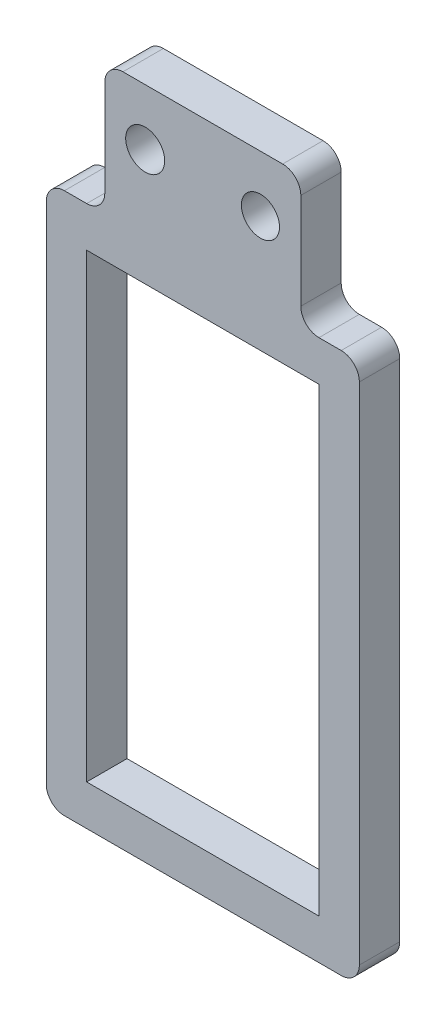
ISO-10303-21;
HEADER;
FILE_DESCRIPTION(('STEP AP214'),'2;1');
FILE_NAME('part.step','',(''),(''),'','','');
FILE_SCHEMA(('AUTOMOTIVE_DESIGN { 1 0 10303 214 1 1 1 1 }'));
ENDSEC;
DATA;
#1=APPLICATION_CONTEXT('core data for automotive mechanical design processes');
#2=APPLICATION_PROTOCOL_DEFINITION('international standard','automotive_design',2000,#1);
#3=PRODUCT_CONTEXT('',#1,'mechanical');
#4=PRODUCT('Part','Part','',(#3));
#5=PRODUCT_RELATED_PRODUCT_CATEGORY('part','',(#4));
#6=PRODUCT_DEFINITION_FORMATION('','',#4);
#7=PRODUCT_DEFINITION_CONTEXT('part definition',#1,'design');
#8=PRODUCT_DEFINITION('design','',#6,#7);
#9=PRODUCT_DEFINITION_SHAPE('','',#8);
#10=(LENGTH_UNIT() NAMED_UNIT(*) SI_UNIT(.MILLI.,.METRE.));
#11=(NAMED_UNIT(*) PLANE_ANGLE_UNIT() SI_UNIT($,.RADIAN.));
#12=(NAMED_UNIT(*) SI_UNIT($,.STERADIAN.) SOLID_ANGLE_UNIT());
#13=UNCERTAINTY_MEASURE_WITH_UNIT(LENGTH_MEASURE(1.E-05),#10,'distance_accuracy_value','');
#14=(GEOMETRIC_REPRESENTATION_CONTEXT(3) GLOBAL_UNCERTAINTY_ASSIGNED_CONTEXT((#13)) GLOBAL_UNIT_ASSIGNED_CONTEXT((#10,
#11,#12)) REPRESENTATION_CONTEXT('',''));
#15=CARTESIAN_POINT('',(0.,0.,0.));
#16=DIRECTION('',(0.,0.,1.));
#17=DIRECTION('',(1.,0.,0.));
#18=AXIS2_PLACEMENT_3D('',#15,#16,#17);
#19=CARTESIAN_POINT('',(0.,0.,4.45));
#20=DIRECTION('',(0.,0.,1.));
#21=DIRECTION('',(1.,0.,0.));
#22=AXIS2_PLACEMENT_3D('',#19,#20,#21);
#23=PLANE('',#22);
#24=CARTESIAN_POINT('',(12.7000000000003,-2.4980018054066E-13,4.45));
#25=DIRECTION('',(0.,0.,1.));
#26=DIRECTION('',(1.,0.,0.));
#27=AXIS2_PLACEMENT_3D('',#24,#25,#26);
#28=CIRCLE('',#27,2.1);
#29=CARTESIAN_POINT('',(14.8000000000003,-2.4980018054066E-13,4.45));
#30=VERTEX_POINT('',#29);
#31=EDGE_CURVE('E309',#30,#30,#28,.F.);
#32=ORIENTED_EDGE('',*,*,#31,.T.);
#33=EDGE_LOOP('',(#32));
#34=FACE_BOUND('',#33,.T.);
#35=DIRECTION('',(0.,-1.,0.));
#36=VECTOR('',#35,1.);
#37=CARTESIAN_POINT('',(-10.9,-8.37499999999999,4.45));
#38=LINE('',#37,#36);
#39=CARTESIAN_POINT('',(-10.9,-10.375,4.45));
#40=VERTEX_POINT('',#39);
#41=CARTESIAN_POINT('',(-10.9,-66.025,4.45));
#42=VERTEX_POINT('',#41);
#43=EDGE_CURVE('E341',#40,#42,#38,.T.);
#44=ORIENTED_EDGE('',*,*,#43,.T.);
#45=CARTESIAN_POINT('',(-8.89999999999997,-66.025,4.45));
#46=DIRECTION('',(0.,0.,1.));
#47=DIRECTION('',(1.,0.,0.));
#48=AXIS2_PLACEMENT_3D('',#45,#46,#47);
#49=CIRCLE('',#48,2.);
#50=CARTESIAN_POINT('',(-8.89999999999997,-68.025,4.45));
#51=VERTEX_POINT('',#50);
#52=EDGE_CURVE('E397',#42,#51,#49,.T.);
#53=ORIENTED_EDGE('',*,*,#52,.T.);
#54=DIRECTION('',(1.,0.,0.));
#55=VECTOR('',#54,1.);
#56=CARTESIAN_POINT('',(-10.9,-68.025,4.45));
#57=LINE('',#56,#55);
#58=CARTESIAN_POINT('',(21.6,-68.025,4.45));
#59=VERTEX_POINT('',#58);
#60=EDGE_CURVE('E338',#51,#59,#57,.T.);
#61=ORIENTED_EDGE('',*,*,#60,.T.);
#62=CARTESIAN_POINT('',(21.6,-66.025,4.45));
#63=DIRECTION('',(0.,0.,1.));
#64=DIRECTION('',(1.,0.,0.));
#65=AXIS2_PLACEMENT_3D('',#62,#63,#64);
#66=CIRCLE('',#65,2.);
#67=CARTESIAN_POINT('',(23.6,-66.025,4.45));
#68=VERTEX_POINT('',#67);
#69=EDGE_CURVE('E395',#59,#68,#66,.T.);
#70=ORIENTED_EDGE('',*,*,#69,.T.);
#71=DIRECTION('',(0.,1.,0.));
#72=VECTOR('',#71,1.);
#73=CARTESIAN_POINT('',(23.6,-68.025,4.45));
#74=LINE('',#73,#72);
#75=CARTESIAN_POINT('',(23.6,-10.375,4.45));
#76=VERTEX_POINT('',#75);
#77=EDGE_CURVE('E335',#68,#76,#74,.T.);
#78=ORIENTED_EDGE('',*,*,#77,.T.);
#79=CARTESIAN_POINT('',(21.6,-10.375,4.45));
#80=DIRECTION('',(0.,0.,1.));
#81=DIRECTION('',(1.,0.,0.));
#82=AXIS2_PLACEMENT_3D('',#79,#80,#81);
#83=CIRCLE('',#82,2.);
#84=CARTESIAN_POINT('',(21.6,-8.37499999999999,4.45));
#85=VERTEX_POINT('',#84);
#86=EDGE_CURVE('E391',#76,#85,#83,.T.);
#87=ORIENTED_EDGE('',*,*,#86,.T.);
#88=DIRECTION('',(-1.,0.,0.));
#89=VECTOR('',#88,1.);
#90=CARTESIAN_POINT('',(23.6,-8.37499999999999,4.45));
#91=LINE('',#90,#89);
#92=CARTESIAN_POINT('',(19.1499999999993,-8.37499999999999,4.45));
#93=VERTEX_POINT('',#92);
#94=EDGE_CURVE('E332',#85,#93,#91,.T.);
#95=ORIENTED_EDGE('',*,*,#94,.T.);
#96=CARTESIAN_POINT('',(19.1499999999993,-6.37499999999999,4.45));
#97=DIRECTION('',(0.,0.,1.));
#98=DIRECTION('',(1.,0.,0.));
#99=AXIS2_PLACEMENT_3D('',#96,#97,#98);
#100=CIRCLE('',#99,2.);
#101=CARTESIAN_POINT('',(17.1499999999993,-6.37499999999999,4.45));
#102=VERTEX_POINT('',#101);
#103=EDGE_CURVE('E430',#93,#102,#100,.F.);
#104=ORIENTED_EDGE('',*,*,#103,.T.);
#105=DIRECTION('',(0.,1.,0.));
#106=VECTOR('',#105,1.);
#107=CARTESIAN_POINT('',(17.1499999999993,-8.37499999999999,4.45));
#108=LINE('',#107,#106);
#109=CARTESIAN_POINT('',(17.1499999999993,4.19999999999979,4.45));
#110=VERTEX_POINT('',#109);
#111=EDGE_CURVE('E329',#102,#110,#108,.T.);
#112=ORIENTED_EDGE('',*,*,#111,.T.);
#113=CARTESIAN_POINT('',(15.1499999999993,4.19999999999979,4.45));
#114=DIRECTION('',(0.,0.,1.));
#115=DIRECTION('',(1.,0.,0.));
#116=AXIS2_PLACEMENT_3D('',#113,#114,#115);
#117=CIRCLE('',#116,2.);
#118=CARTESIAN_POINT('',(15.1499999999993,6.19999999999979,4.45));
#119=VERTEX_POINT('',#118);
#120=EDGE_CURVE('E389',#110,#119,#117,.T.);
#121=ORIENTED_EDGE('',*,*,#120,.T.);
#122=DIRECTION('',(-1.,0.,0.));
#123=VECTOR('',#122,1.);
#124=CARTESIAN_POINT('',(17.1499999999993,6.19999999999979,4.45));
#125=LINE('',#124,#123);
#126=CARTESIAN_POINT('',(-2.45,6.19999999999979,4.45));
#127=VERTEX_POINT('',#126);
#128=EDGE_CURVE('E327',#119,#127,#125,.T.);
#129=ORIENTED_EDGE('',*,*,#128,.T.);
#130=CARTESIAN_POINT('',(-2.45,4.19999999999979,4.45));
#131=DIRECTION('',(0.,0.,1.));
#132=DIRECTION('',(1.,0.,0.));
#133=AXIS2_PLACEMENT_3D('',#130,#131,#132);
#134=CIRCLE('',#133,2.);
#135=CARTESIAN_POINT('',(-4.45,4.19999999999979,4.45));
#136=VERTEX_POINT('',#135);
#137=EDGE_CURVE('E144',#127,#136,#134,.T.);
#138=ORIENTED_EDGE('',*,*,#137,.T.);
#139=DIRECTION('',(0.,1.,0.));
#140=VECTOR('',#139,1.);
#141=CARTESIAN_POINT('',(-4.45,-8.37499999999999,4.45));
#142=LINE('',#141,#140);
#143=CARTESIAN_POINT('',(-4.45,-6.37499999999999,4.45));
#144=VERTEX_POINT('',#143);
#145=EDGE_CURVE('E324',#144,#136,#142,.T.);
#146=ORIENTED_EDGE('',*,*,#145,.F.);
#147=CARTESIAN_POINT('',(-6.45,-6.37499999999999,4.45));
#148=DIRECTION('',(0.,0.,1.));
#149=DIRECTION('',(1.,0.,0.));
#150=AXIS2_PLACEMENT_3D('',#147,#148,#149);
#151=CIRCLE('',#150,2.);
#152=CARTESIAN_POINT('',(-6.45,-8.37499999999999,4.45));
#153=VERTEX_POINT('',#152);
#154=EDGE_CURVE('E12',#144,#153,#151,.F.);
#155=ORIENTED_EDGE('',*,*,#154,.T.);
#156=DIRECTION('',(1.,0.,0.));
#157=VECTOR('',#156,1.);
#158=CARTESIAN_POINT('',(-10.9,-8.37499999999999,4.45));
#159=LINE('',#158,#157);
#160=CARTESIAN_POINT('',(-8.89999999999998,-8.37499999999999,4.45));
#161=VERTEX_POINT('',#160);
#162=EDGE_CURVE('E321',#161,#153,#159,.T.);
#163=ORIENTED_EDGE('',*,*,#162,.F.);
#164=CARTESIAN_POINT('',(-8.89999999999998,-10.375,4.45));
#165=DIRECTION('',(0.,0.,1.));
#166=DIRECTION('',(1.,0.,0.));
#167=AXIS2_PLACEMENT_3D('',#164,#165,#166);
#168=CIRCLE('',#167,2.);
#169=EDGE_CURVE('E393',#161,#40,#168,.T.);
#170=ORIENTED_EDGE('',*,*,#169,.T.);
#171=EDGE_LOOP('',(#44,#53,#61,#70,#78,#87,#95,#104,#112,#121,#129,#138,#146,#155,#163,#170));
#172=FACE_BOUND('',#171,.T.);
#173=CARTESIAN_POINT('',(0.,0.,4.45));
#174=DIRECTION('',(0.,0.,1.));
#175=DIRECTION('',(1.,0.,0.));
#176=AXIS2_PLACEMENT_3D('',#173,#174,#175);
#177=CIRCLE('',#176,2.15);
#178=CARTESIAN_POINT('',(2.15,0.,4.45));
#179=VERTEX_POINT('',#178);
#180=EDGE_CURVE('E315',#179,#179,#177,.T.);
#181=ORIENTED_EDGE('',*,*,#180,.F.);
#182=EDGE_LOOP('',(#181));
#183=FACE_BOUND('',#182,.T.);
#184=DIRECTION('',(0.,-1.,0.));
#185=VECTOR('',#184,1.);
#186=CARTESIAN_POINT('',(-6.44999999999999,0.,4.45));
#187=LINE('',#186,#185);
#188=CARTESIAN_POINT('',(-6.44999999999999,-12.825,4.45));
#189=VERTEX_POINT('',#188);
#190=CARTESIAN_POINT('',(-6.44999999999998,-63.575,4.45));
#191=VERTEX_POINT('',#190);
#192=EDGE_CURVE('E278',#189,#191,#187,.T.);
#193=ORIENTED_EDGE('',*,*,#192,.F.);
#194=DIRECTION('',(-1.,0.,0.));
#195=VECTOR('',#194,1.);
#196=CARTESIAN_POINT('',(0.,-12.825,4.45));
#197=LINE('',#196,#195);
#198=CARTESIAN_POINT('',(19.15,-12.825,4.45));
#199=VERTEX_POINT('',#198);
#200=EDGE_CURVE('E268',#199,#189,#197,.T.);
#201=ORIENTED_EDGE('',*,*,#200,.F.);
#202=DIRECTION('',(0.,1.,0.));
#203=VECTOR('',#202,1.);
#204=CARTESIAN_POINT('',(19.15,0.,4.45));
#205=LINE('',#204,#203);
#206=CARTESIAN_POINT('',(19.15,-63.575,4.45));
#207=VERTEX_POINT('',#206);
#208=EDGE_CURVE('E293',#207,#199,#205,.T.);
#209=ORIENTED_EDGE('',*,*,#208,.F.);
#210=DIRECTION('',(1.,0.,0.));
#211=VECTOR('',#210,1.);
#212=CARTESIAN_POINT('',(0.,-63.575,4.45));
#213=LINE('',#212,#211);
#214=EDGE_CURVE('E291',#191,#207,#213,.T.);
#215=ORIENTED_EDGE('',*,*,#214,.F.);
#216=EDGE_LOOP('',(#193,#201,#209,#215));
#217=FACE_BOUND('',#216,.T.);
#218=ADVANCED_FACE('F129',(#34,#172,#183,#217),#23,.T.);
#219=CARTESIAN_POINT('',(0.,0.,0.));
#220=DIRECTION('',(0.,0.,1.));
#221=DIRECTION('',(1.,0.,0.));
#222=AXIS2_PLACEMENT_3D('',#219,#220,#221);
#223=PLANE('',#222);
#224=CARTESIAN_POINT('',(0.,0.,0.));
#225=DIRECTION('',(0.,0.,1.));
#226=DIRECTION('',(1.,0.,0.));
#227=AXIS2_PLACEMENT_3D('',#224,#225,#226);
#228=CIRCLE('',#227,2.15);
#229=CARTESIAN_POINT('',(2.15,0.,0.));
#230=VERTEX_POINT('',#229);
#231=EDGE_CURVE('E312',#230,#230,#228,.T.);
#232=ORIENTED_EDGE('',*,*,#231,.T.);
#233=EDGE_LOOP('',(#232));
#234=FACE_BOUND('',#233,.T.);
#235=DIRECTION('',(1.,0.,0.));
#236=VECTOR('',#235,1.);
#237=CARTESIAN_POINT('',(-10.9,-68.025,0.));
#238=LINE('',#237,#236);
#239=CARTESIAN_POINT('',(-8.89999999999997,-68.025,0.));
#240=VERTEX_POINT('',#239);
#241=CARTESIAN_POINT('',(21.6,-68.025,0.));
#242=VERTEX_POINT('',#241);
#243=EDGE_CURVE('E362',#240,#242,#238,.T.);
#244=ORIENTED_EDGE('',*,*,#243,.F.);
#245=CARTESIAN_POINT('',(-8.89999999999997,-66.025,0.));
#246=DIRECTION('',(0.,0.,1.));
#247=DIRECTION('',(1.,0.,0.));
#248=AXIS2_PLACEMENT_3D('',#245,#246,#247);
#249=CIRCLE('',#248,2.);
#250=CARTESIAN_POINT('',(-10.9,-66.025,0.));
#251=VERTEX_POINT('',#250);
#252=EDGE_CURVE('E381',#240,#251,#249,.F.);
#253=ORIENTED_EDGE('',*,*,#252,.T.);
#254=DIRECTION('',(0.,-1.,0.));
#255=VECTOR('',#254,1.);
#256=CARTESIAN_POINT('',(-10.9,-8.37499999999999,0.));
#257=LINE('',#256,#255);
#258=CARTESIAN_POINT('',(-10.9,-10.375,0.));
#259=VERTEX_POINT('',#258);
#260=EDGE_CURVE('E325',#259,#251,#257,.T.);
#261=ORIENTED_EDGE('',*,*,#260,.F.);
#262=CARTESIAN_POINT('',(-8.89999999999998,-10.375,0.));
#263=DIRECTION('',(0.,0.,1.));
#264=DIRECTION('',(1.,0.,0.));
#265=AXIS2_PLACEMENT_3D('',#262,#263,#264);
#266=CIRCLE('',#265,2.);
#267=CARTESIAN_POINT('',(-8.89999999999998,-8.37499999999999,0.));
#268=VERTEX_POINT('',#267);
#269=EDGE_CURVE('E377',#259,#268,#266,.F.);
#270=ORIENTED_EDGE('',*,*,#269,.T.);
#271=DIRECTION('',(1.,0.,0.));
#272=VECTOR('',#271,1.);
#273=CARTESIAN_POINT('',(-10.9,-8.37499999999999,0.));
#274=LINE('',#273,#272);
#275=CARTESIAN_POINT('',(-6.45,-8.37499999999999,0.));
#276=VERTEX_POINT('',#275);
#277=EDGE_CURVE('E318',#268,#276,#274,.T.);
#278=ORIENTED_EDGE('',*,*,#277,.T.);
#279=CARTESIAN_POINT('',(-6.45,-6.37499999999999,0.));
#280=DIRECTION('',(0.,0.,1.));
#281=DIRECTION('',(1.,0.,0.));
#282=AXIS2_PLACEMENT_3D('',#279,#280,#281);
#283=CIRCLE('',#282,2.);
#284=CARTESIAN_POINT('',(-4.45,-6.37499999999999,0.));
#285=VERTEX_POINT('',#284);
#286=EDGE_CURVE('E137',#276,#285,#283,.T.);
#287=ORIENTED_EDGE('',*,*,#286,.T.);
#288=DIRECTION('',(0.,1.,0.));
#289=VECTOR('',#288,1.);
#290=CARTESIAN_POINT('',(-4.45,-8.37499999999999,0.));
#291=LINE('',#290,#289);
#292=CARTESIAN_POINT('',(-4.45,4.19999999999979,0.));
#293=VERTEX_POINT('',#292);
#294=EDGE_CURVE('E347',#285,#293,#291,.T.);
#295=ORIENTED_EDGE('',*,*,#294,.T.);
#296=CARTESIAN_POINT('',(-2.45,4.19999999999979,0.));
#297=DIRECTION('',(0.,0.,1.));
#298=DIRECTION('',(1.,0.,0.));
#299=AXIS2_PLACEMENT_3D('',#296,#297,#298);
#300=CIRCLE('',#299,2.);
#301=CARTESIAN_POINT('',(-2.45,6.19999999999979,0.));
#302=VERTEX_POINT('',#301);
#303=EDGE_CURVE('E371',#293,#302,#300,.F.);
#304=ORIENTED_EDGE('',*,*,#303,.T.);
#305=DIRECTION('',(-1.,0.,0.));
#306=VECTOR('',#305,1.);
#307=CARTESIAN_POINT('',(17.1499999999993,6.19999999999979,0.));
#308=LINE('',#307,#306);
#309=CARTESIAN_POINT('',(15.1499999999993,6.19999999999979,0.));
#310=VERTEX_POINT('',#309);
#311=EDGE_CURVE('E350',#310,#302,#308,.T.);
#312=ORIENTED_EDGE('',*,*,#311,.F.);
#313=CARTESIAN_POINT('',(15.1499999999993,4.19999999999979,0.));
#314=DIRECTION('',(0.,0.,1.));
#315=DIRECTION('',(1.,0.,0.));
#316=AXIS2_PLACEMENT_3D('',#313,#314,#315);
#317=CIRCLE('',#316,2.);
#318=CARTESIAN_POINT('',(17.1499999999993,4.19999999999979,0.));
#319=VERTEX_POINT('',#318);
#320=EDGE_CURVE('E373',#310,#319,#317,.F.);
#321=ORIENTED_EDGE('',*,*,#320,.T.);
#322=DIRECTION('',(0.,1.,0.));
#323=VECTOR('',#322,1.);
#324=CARTESIAN_POINT('',(17.1499999999993,-8.37499999999999,0.));
#325=LINE('',#324,#323);
#326=CARTESIAN_POINT('',(17.1499999999993,-6.37499999999999,0.));
#327=VERTEX_POINT('',#326);
#328=EDGE_CURVE('E353',#327,#319,#325,.T.);
#329=ORIENTED_EDGE('',*,*,#328,.F.);
#330=CARTESIAN_POINT('',(19.1499999999993,-6.37499999999999,0.));
#331=DIRECTION('',(0.,0.,1.));
#332=DIRECTION('',(1.,0.,0.));
#333=AXIS2_PLACEMENT_3D('',#330,#331,#332);
#334=CIRCLE('',#333,2.);
#335=CARTESIAN_POINT('',(19.1499999999993,-8.37499999999999,0.));
#336=VERTEX_POINT('',#335);
#337=EDGE_CURVE('E428',#327,#336,#334,.T.);
#338=ORIENTED_EDGE('',*,*,#337,.T.);
#339=DIRECTION('',(-1.,0.,0.));
#340=VECTOR('',#339,1.);
#341=CARTESIAN_POINT('',(23.6,-8.37499999999999,0.));
#342=LINE('',#341,#340);
#343=CARTESIAN_POINT('',(21.6,-8.37499999999999,0.));
#344=VERTEX_POINT('',#343);
#345=EDGE_CURVE('E356',#344,#336,#342,.T.);
#346=ORIENTED_EDGE('',*,*,#345,.F.);
#347=CARTESIAN_POINT('',(21.6,-10.375,0.));
#348=DIRECTION('',(0.,0.,1.));
#349=DIRECTION('',(1.,0.,0.));
#350=AXIS2_PLACEMENT_3D('',#347,#348,#349);
#351=CIRCLE('',#350,2.);
#352=CARTESIAN_POINT('',(23.6,-10.375,0.));
#353=VERTEX_POINT('',#352);
#354=EDGE_CURVE('E375',#344,#353,#351,.F.);
#355=ORIENTED_EDGE('',*,*,#354,.T.);
#356=DIRECTION('',(0.,1.,0.));
#357=VECTOR('',#356,1.);
#358=CARTESIAN_POINT('',(23.6,-68.025,0.));
#359=LINE('',#358,#357);
#360=CARTESIAN_POINT('',(23.6,-66.025,0.));
#361=VERTEX_POINT('',#360);
#362=EDGE_CURVE('E359',#361,#353,#359,.T.);
#363=ORIENTED_EDGE('',*,*,#362,.F.);
#364=CARTESIAN_POINT('',(21.6,-66.025,0.));
#365=DIRECTION('',(0.,0.,1.));
#366=DIRECTION('',(1.,0.,0.));
#367=AXIS2_PLACEMENT_3D('',#364,#365,#366);
#368=CIRCLE('',#367,2.);
#369=EDGE_CURVE('E379',#361,#242,#368,.F.);
#370=ORIENTED_EDGE('',*,*,#369,.T.);
#371=EDGE_LOOP('',(#244,#253,#261,#270,#278,#287,#295,#304,#312,#321,#329,#338,#346,#355,#363,#370));
#372=FACE_BOUND('',#371,.T.);
#373=CARTESIAN_POINT('',(12.7000000000003,-2.4980018054066E-13,0.));
#374=DIRECTION('',(0.,0.,1.));
#375=DIRECTION('',(1.,0.,0.));
#376=AXIS2_PLACEMENT_3D('',#373,#374,#375);
#377=CIRCLE('',#376,2.1);
#378=CARTESIAN_POINT('',(14.8000000000003,-2.4980018054066E-13,0.));
#379=VERTEX_POINT('',#378);
#380=EDGE_CURVE('E286',#379,#379,#377,.F.);
#381=ORIENTED_EDGE('',*,*,#380,.F.);
#382=EDGE_LOOP('',(#381));
#383=FACE_BOUND('',#382,.T.);
#384=DIRECTION('',(-1.,0.,0.));
#385=VECTOR('',#384,1.);
#386=CARTESIAN_POINT('',(0.,-12.825,0.));
#387=LINE('',#386,#385);
#388=CARTESIAN_POINT('',(19.15,-12.825,0.));
#389=VERTEX_POINT('',#388);
#390=CARTESIAN_POINT('',(-6.44999999999999,-12.825,0.));
#391=VERTEX_POINT('',#390);
#392=EDGE_CURVE('E297',#389,#391,#387,.T.);
#393=ORIENTED_EDGE('',*,*,#392,.T.);
#394=DIRECTION('',(0.,-1.,0.));
#395=VECTOR('',#394,1.);
#396=CARTESIAN_POINT('',(-6.44999999999999,0.,0.));
#397=LINE('',#396,#395);
#398=CARTESIAN_POINT('',(-6.44999999999998,-63.575,0.));
#399=VERTEX_POINT('',#398);
#400=EDGE_CURVE('E285',#391,#399,#397,.T.);
#401=ORIENTED_EDGE('',*,*,#400,.T.);
#402=DIRECTION('',(1.,0.,0.));
#403=VECTOR('',#402,1.);
#404=CARTESIAN_POINT('',(0.,-63.575,0.));
#405=LINE('',#404,#403);
#406=CARTESIAN_POINT('',(19.15,-63.575,0.));
#407=VERTEX_POINT('',#406);
#408=EDGE_CURVE('E300',#399,#407,#405,.T.);
#409=ORIENTED_EDGE('',*,*,#408,.T.);
#410=DIRECTION('',(0.,1.,0.));
#411=VECTOR('',#410,1.);
#412=CARTESIAN_POINT('',(19.15,0.,0.));
#413=LINE('',#412,#411);
#414=EDGE_CURVE('E279',#407,#389,#413,.T.);
#415=ORIENTED_EDGE('',*,*,#414,.T.);
#416=EDGE_LOOP('',(#393,#401,#409,#415));
#417=FACE_BOUND('',#416,.T.);
#418=ADVANCED_FACE('F433',(#234,#372,#383,#417),#223,.F.);
#419=CARTESIAN_POINT('',(-10.9,-8.37499999999999,4.45));
#420=DIRECTION('',(0.,1.,0.));
#421=DIRECTION('',(0.,0.,1.));
#422=AXIS2_PLACEMENT_3D('',#419,#420,#421);
#423=PLANE('',#422);
#424=ORIENTED_EDGE('',*,*,#277,.F.);
#425=DIRECTION('',(0.,0.,-1.));
#426=VECTOR('',#425,1.);
#427=CARTESIAN_POINT('',(-8.89999999999998,-8.37499999999999,4.45));
#428=LINE('',#427,#426);
#429=EDGE_CURVE('E407',#268,#161,#428,.F.);
#430=ORIENTED_EDGE('',*,*,#429,.T.);
#431=ORIENTED_EDGE('',*,*,#162,.T.);
#432=DIRECTION('',(0.,0.,-1.));
#433=VECTOR('',#432,1.);
#434=CARTESIAN_POINT('',(-6.45,-8.37499999999999,0.));
#435=LINE('',#434,#433);
#436=EDGE_CURVE('E404',#153,#276,#435,.T.);
#437=ORIENTED_EDGE('',*,*,#436,.T.);
#438=EDGE_LOOP('',(#424,#430,#431,#437));
#439=FACE_BOUND('',#438,.T.);
#440=ADVANCED_FACE('F445',(#439),#423,.T.);
#441=CARTESIAN_POINT('',(-10.9,-8.37499999999999,4.45));
#442=DIRECTION('',(1.,0.,0.));
#443=DIRECTION('',(0.,1.,0.));
#444=AXIS2_PLACEMENT_3D('',#441,#442,#443);
#445=PLANE('',#444);
#446=ORIENTED_EDGE('',*,*,#260,.T.);
#447=DIRECTION('',(0.,0.,-1.));
#448=VECTOR('',#447,1.);
#449=CARTESIAN_POINT('',(-10.9,-66.025,4.45));
#450=LINE('',#449,#448);
#451=EDGE_CURVE('E386',#251,#42,#450,.F.);
#452=ORIENTED_EDGE('',*,*,#451,.T.);
#453=ORIENTED_EDGE('',*,*,#43,.F.);
#454=DIRECTION('',(0.,0.,-1.));
#455=VECTOR('',#454,1.);
#456=CARTESIAN_POINT('',(-10.9,-10.375,0.));
#457=LINE('',#456,#455);
#458=EDGE_CURVE('E383',#40,#259,#457,.T.);
#459=ORIENTED_EDGE('',*,*,#458,.T.);
#460=EDGE_LOOP('',(#446,#452,#453,#459));
#461=FACE_BOUND('',#460,.T.);
#462=ADVANCED_FACE('F453',(#461),#445,.F.);
#463=CARTESIAN_POINT('',(-10.9,-68.025,4.45));
#464=DIRECTION('',(0.,1.,0.));
#465=DIRECTION('',(-1.,0.,0.));
#466=AXIS2_PLACEMENT_3D('',#463,#464,#465);
#467=PLANE('',#466);
#468=ORIENTED_EDGE('',*,*,#60,.F.);
#469=DIRECTION('',(0.,0.,-1.));
#470=VECTOR('',#469,1.);
#471=CARTESIAN_POINT('',(-8.89999999999997,-68.025,4.45));
#472=LINE('',#471,#470);
#473=EDGE_CURVE('E368',#51,#240,#472,.T.);
#474=ORIENTED_EDGE('',*,*,#473,.T.);
#475=ORIENTED_EDGE('',*,*,#243,.T.);
#476=DIRECTION('',(0.,0.,-1.));
#477=VECTOR('',#476,1.);
#478=CARTESIAN_POINT('',(21.6,-68.025,4.45));
#479=LINE('',#478,#477);
#480=EDGE_CURVE('E344',#242,#59,#479,.F.);
#481=ORIENTED_EDGE('',*,*,#480,.T.);
#482=EDGE_LOOP('',(#468,#474,#475,#481));
#483=FACE_BOUND('',#482,.T.);
#484=ADVANCED_FACE('F462',(#483),#467,.F.);
#485=CARTESIAN_POINT('',(23.6,-68.025,4.45));
#486=DIRECTION('',(-1.,0.,0.));
#487=DIRECTION('',(0.,-1.,0.));
#488=AXIS2_PLACEMENT_3D('',#485,#486,#487);
#489=PLANE('',#488);
#490=ORIENTED_EDGE('',*,*,#77,.F.);
#491=DIRECTION('',(0.,0.,-1.));
#492=VECTOR('',#491,1.);
#493=CARTESIAN_POINT('',(23.6,-66.025,4.45));
#494=LINE('',#493,#492);
#495=EDGE_CURVE('E401',#68,#361,#494,.T.);
#496=ORIENTED_EDGE('',*,*,#495,.T.);
#497=ORIENTED_EDGE('',*,*,#362,.T.);
#498=DIRECTION('',(0.,0.,-1.));
#499=VECTOR('',#498,1.);
#500=CARTESIAN_POINT('',(23.6,-10.375,4.45));
#501=LINE('',#500,#499);
#502=EDGE_CURVE('E399',#353,#76,#501,.F.);
#503=ORIENTED_EDGE('',*,*,#502,.T.);
#504=EDGE_LOOP('',(#490,#496,#497,#503));
#505=FACE_BOUND('',#504,.T.);
#506=ADVANCED_FACE('F470',(#505),#489,.F.);
#507=CARTESIAN_POINT('',(23.6,-8.37499999999999,4.45));
#508=DIRECTION('',(0.,-1.,0.));
#509=DIRECTION('',(0.,0.,-1.));
#510=AXIS2_PLACEMENT_3D('',#507,#508,#509);
#511=PLANE('',#510);
#512=ORIENTED_EDGE('',*,*,#94,.F.);
#513=DIRECTION('',(0.,0.,-1.));
#514=VECTOR('',#513,1.);
#515=CARTESIAN_POINT('',(21.6,-8.37499999999999,4.45));
#516=LINE('',#515,#514);
#517=EDGE_CURVE('E411',#85,#344,#516,.T.);
#518=ORIENTED_EDGE('',*,*,#517,.T.);
#519=ORIENTED_EDGE('',*,*,#345,.T.);
#520=DIRECTION('',(0.,0.,-1.));
#521=VECTOR('',#520,1.);
#522=CARTESIAN_POINT('',(19.1499999999993,-8.37499999999999,4.45));
#523=LINE('',#522,#521);
#524=EDGE_CURVE('E409',#336,#93,#523,.F.);
#525=ORIENTED_EDGE('',*,*,#524,.T.);
#526=EDGE_LOOP('',(#512,#518,#519,#525));
#527=FACE_BOUND('',#526,.T.);
#528=ADVANCED_FACE('F479',(#527),#511,.F.);
#529=CARTESIAN_POINT('',(17.1499999999993,-8.37499999999999,4.45));
#530=DIRECTION('',(-1.,0.,0.));
#531=DIRECTION('',(0.,0.,1.));
#532=AXIS2_PLACEMENT_3D('',#529,#530,#531);
#533=PLANE('',#532);
#534=ORIENTED_EDGE('',*,*,#111,.F.);
#535=DIRECTION('',(0.,0.,-1.));
#536=VECTOR('',#535,1.);
#537=CARTESIAN_POINT('',(17.1499999999993,-6.37499999999999,0.));
#538=LINE('',#537,#536);
#539=EDGE_CURVE('E416',#102,#327,#538,.T.);
#540=ORIENTED_EDGE('',*,*,#539,.T.);
#541=ORIENTED_EDGE('',*,*,#328,.T.);
#542=DIRECTION('',(0.,0.,-1.));
#543=VECTOR('',#542,1.);
#544=CARTESIAN_POINT('',(17.1499999999993,4.19999999999979,4.45));
#545=LINE('',#544,#543);
#546=EDGE_CURVE('E414',#319,#110,#545,.F.);
#547=ORIENTED_EDGE('',*,*,#546,.T.);
#548=EDGE_LOOP('',(#534,#540,#541,#547));
#549=FACE_BOUND('',#548,.T.);
#550=ADVANCED_FACE('F488',(#549),#533,.F.);
#551=CARTESIAN_POINT('',(17.1499999999993,6.19999999999979,4.45));
#552=DIRECTION('',(0.,-1.,0.));
#553=DIRECTION('',(0.,0.,-1.));
#554=AXIS2_PLACEMENT_3D('',#551,#552,#553);
#555=PLANE('',#554);
#556=ORIENTED_EDGE('',*,*,#128,.F.);
#557=DIRECTION('',(0.,0.,-1.));
#558=VECTOR('',#557,1.);
#559=CARTESIAN_POINT('',(15.1499999999993,6.19999999999979,4.45));
#560=LINE('',#559,#558);
#561=EDGE_CURVE('E421',#119,#310,#560,.T.);
#562=ORIENTED_EDGE('',*,*,#561,.T.);
#563=ORIENTED_EDGE('',*,*,#311,.T.);
#564=DIRECTION('',(0.,0.,-1.));
#565=VECTOR('',#564,1.);
#566=CARTESIAN_POINT('',(-2.45,6.19999999999979,4.45));
#567=LINE('',#566,#565);
#568=EDGE_CURVE('E419',#302,#127,#567,.F.);
#569=ORIENTED_EDGE('',*,*,#568,.T.);
#570=EDGE_LOOP('',(#556,#562,#563,#569));
#571=FACE_BOUND('',#570,.T.);
#572=ADVANCED_FACE('F496',(#571),#555,.F.);
#573=CARTESIAN_POINT('',(-4.45,-8.37499999999999,4.45));
#574=DIRECTION('',(-1.,0.,0.));
#575=DIRECTION('',(0.,0.,1.));
#576=AXIS2_PLACEMENT_3D('',#573,#574,#575);
#577=PLANE('',#576);
#578=ORIENTED_EDGE('',*,*,#145,.T.);
#579=DIRECTION('',(0.,0.,-1.));
#580=VECTOR('',#579,1.);
#581=CARTESIAN_POINT('',(-4.45,4.19999999999979,0.));
#582=LINE('',#581,#580);
#583=EDGE_CURVE('E425',#136,#293,#582,.T.);
#584=ORIENTED_EDGE('',*,*,#583,.T.);
#585=ORIENTED_EDGE('',*,*,#294,.F.);
#586=DIRECTION('',(0.,0.,-1.));
#587=VECTOR('',#586,1.);
#588=CARTESIAN_POINT('',(-4.45,-6.37499999999999,4.45));
#589=LINE('',#588,#587);
#590=EDGE_CURVE('E151',#285,#144,#589,.F.);
#591=ORIENTED_EDGE('',*,*,#590,.T.);
#592=EDGE_LOOP('',(#578,#584,#585,#591));
#593=FACE_BOUND('',#592,.T.);
#594=ADVANCED_FACE('F438',(#593),#577,.T.);
#595=CARTESIAN_POINT('',(0.,0.,4.45));
#596=DIRECTION('',(0.,0.,-1.));
#597=DIRECTION('',(-1.,0.,0.));
#598=AXIS2_PLACEMENT_3D('',#595,#596,#597);
#599=CYLINDRICAL_SURFACE('',#598,2.15);
#600=ORIENTED_EDGE('',*,*,#180,.T.);
#601=EDGE_LOOP('',(#600));
#602=FACE_BOUND('',#601,.T.);
#603=ORIENTED_EDGE('',*,*,#231,.F.);
#604=EDGE_LOOP('',(#603));
#605=FACE_BOUND('',#604,.T.);
#606=ADVANCED_FACE('F517',(#602,#605),#599,.F.);
#607=CARTESIAN_POINT('',(12.7000000000003,-2.4980018054066E-13,4.45));
#608=DIRECTION('',(0.,0.,-1.));
#609=DIRECTION('',(-1.,0.,0.));
#610=AXIS2_PLACEMENT_3D('',#607,#608,#609);
#611=CYLINDRICAL_SURFACE('',#610,2.1);
#612=ORIENTED_EDGE('',*,*,#31,.F.);
#613=EDGE_LOOP('',(#612));
#614=FACE_BOUND('',#613,.T.);
#615=ORIENTED_EDGE('',*,*,#380,.T.);
#616=EDGE_LOOP('',(#615));
#617=FACE_BOUND('',#616,.T.);
#618=ADVANCED_FACE('F617',(#614,#617),#611,.F.);
#619=CARTESIAN_POINT('',(0.,-12.825,4.45));
#620=DIRECTION('',(0.,-1.,0.));
#621=DIRECTION('',(1.,0.,0.));
#622=AXIS2_PLACEMENT_3D('',#619,#620,#621);
#623=PLANE('',#622);
#624=ORIENTED_EDGE('',*,*,#392,.F.);
#625=DIRECTION('',(0.,0.,-1.));
#626=VECTOR('',#625,1.);
#627=CARTESIAN_POINT('',(19.15,-12.825,4.45));
#628=LINE('',#627,#626);
#629=EDGE_CURVE('E274',#199,#389,#628,.T.);
#630=ORIENTED_EDGE('',*,*,#629,.F.);
#631=ORIENTED_EDGE('',*,*,#200,.T.);
#632=DIRECTION('',(0.,0.,-1.));
#633=VECTOR('',#632,1.);
#634=CARTESIAN_POINT('',(-6.44999999999999,-12.825,4.45));
#635=LINE('',#634,#633);
#636=EDGE_CURVE('E271',#189,#391,#635,.T.);
#637=ORIENTED_EDGE('',*,*,#636,.T.);
#638=EDGE_LOOP('',(#624,#630,#631,#637));
#639=FACE_BOUND('',#638,.T.);
#640=ADVANCED_FACE('F270',(#639),#623,.T.);
#641=CARTESIAN_POINT('',(-6.44999999999999,0.,4.45));
#642=DIRECTION('',(1.,0.,0.));
#643=DIRECTION('',(0.,1.,0.));
#644=AXIS2_PLACEMENT_3D('',#641,#642,#643);
#645=PLANE('',#644);
#646=ORIENTED_EDGE('',*,*,#400,.F.);
#647=ORIENTED_EDGE('',*,*,#636,.F.);
#648=ORIENTED_EDGE('',*,*,#192,.T.);
#649=DIRECTION('',(0.,0.,-1.));
#650=VECTOR('',#649,1.);
#651=CARTESIAN_POINT('',(-6.44999999999998,-63.575,4.45));
#652=LINE('',#651,#650);
#653=EDGE_CURVE('E287',#191,#399,#652,.T.);
#654=ORIENTED_EDGE('',*,*,#653,.T.);
#655=EDGE_LOOP('',(#646,#647,#648,#654));
#656=FACE_BOUND('',#655,.T.);
#657=ADVANCED_FACE('F282',(#656),#645,.T.);
#658=CARTESIAN_POINT('',(0.,-63.575,4.45));
#659=DIRECTION('',(0.,1.,0.));
#660=DIRECTION('',(0.,0.,1.));
#661=AXIS2_PLACEMENT_3D('',#658,#659,#660);
#662=PLANE('',#661);
#663=ORIENTED_EDGE('',*,*,#408,.F.);
#664=ORIENTED_EDGE('',*,*,#653,.F.);
#665=ORIENTED_EDGE('',*,*,#214,.T.);
#666=DIRECTION('',(0.,0.,-1.));
#667=VECTOR('',#666,1.);
#668=CARTESIAN_POINT('',(19.15,-63.575,4.45));
#669=LINE('',#668,#667);
#670=EDGE_CURVE('E306',#207,#407,#669,.T.);
#671=ORIENTED_EDGE('',*,*,#670,.T.);
#672=EDGE_LOOP('',(#663,#664,#665,#671));
#673=FACE_BOUND('',#672,.T.);
#674=ADVANCED_FACE('F593',(#673),#662,.T.);
#675=CARTESIAN_POINT('',(19.15,0.,4.45));
#676=DIRECTION('',(-1.,0.,0.));
#677=DIRECTION('',(0.,0.,1.));
#678=AXIS2_PLACEMENT_3D('',#675,#676,#677);
#679=PLANE('',#678);
#680=ORIENTED_EDGE('',*,*,#414,.F.);
#681=ORIENTED_EDGE('',*,*,#670,.F.);
#682=ORIENTED_EDGE('',*,*,#208,.T.);
#683=ORIENTED_EDGE('',*,*,#629,.T.);
#684=EDGE_LOOP('',(#680,#681,#682,#683));
#685=FACE_BOUND('',#684,.T.);
#686=ADVANCED_FACE('F538',(#685),#679,.T.);
#687=CARTESIAN_POINT('',(-8.89999999999997,-66.025,4.45));
#688=DIRECTION('',(0.,0.,-1.));
#689=DIRECTION('',(-1.,0.,0.));
#690=AXIS2_PLACEMENT_3D('',#687,#688,#689);
#691=CYLINDRICAL_SURFACE('',#690,2.);
#692=ORIENTED_EDGE('',*,*,#52,.F.);
#693=ORIENTED_EDGE('',*,*,#451,.F.);
#694=ORIENTED_EDGE('',*,*,#252,.F.);
#695=ORIENTED_EDGE('',*,*,#473,.F.);
#696=EDGE_LOOP('',(#692,#693,#694,#695));
#697=FACE_BOUND('',#696,.T.);
#698=ADVANCED_FACE('F457',(#697),#691,.T.);
#699=CARTESIAN_POINT('',(21.6,-66.025,4.45));
#700=DIRECTION('',(0.,0.,-1.));
#701=DIRECTION('',(-1.,0.,0.));
#702=AXIS2_PLACEMENT_3D('',#699,#700,#701);
#703=CYLINDRICAL_SURFACE('',#702,2.);
#704=ORIENTED_EDGE('',*,*,#69,.F.);
#705=ORIENTED_EDGE('',*,*,#480,.F.);
#706=ORIENTED_EDGE('',*,*,#369,.F.);
#707=ORIENTED_EDGE('',*,*,#495,.F.);
#708=EDGE_LOOP('',(#704,#705,#706,#707));
#709=FACE_BOUND('',#708,.T.);
#710=ADVANCED_FACE('F465',(#709),#703,.T.);
#711=CARTESIAN_POINT('',(-8.89999999999998,-10.375,4.45));
#712=DIRECTION('',(0.,0.,1.));
#713=DIRECTION('',(1.,0.,0.));
#714=AXIS2_PLACEMENT_3D('',#711,#712,#713);
#715=CYLINDRICAL_SURFACE('',#714,2.);
#716=ORIENTED_EDGE('',*,*,#169,.F.);
#717=ORIENTED_EDGE('',*,*,#429,.F.);
#718=ORIENTED_EDGE('',*,*,#269,.F.);
#719=ORIENTED_EDGE('',*,*,#458,.F.);
#720=EDGE_LOOP('',(#716,#717,#718,#719));
#721=FACE_BOUND('',#720,.T.);
#722=ADVANCED_FACE('F448',(#721),#715,.T.);
#723=CARTESIAN_POINT('',(21.6,-10.375,4.45));
#724=DIRECTION('',(0.,0.,-1.));
#725=DIRECTION('',(-1.,0.,0.));
#726=AXIS2_PLACEMENT_3D('',#723,#724,#725);
#727=CYLINDRICAL_SURFACE('',#726,2.);
#728=ORIENTED_EDGE('',*,*,#86,.F.);
#729=ORIENTED_EDGE('',*,*,#502,.F.);
#730=ORIENTED_EDGE('',*,*,#354,.F.);
#731=ORIENTED_EDGE('',*,*,#517,.F.);
#732=EDGE_LOOP('',(#728,#729,#730,#731));
#733=FACE_BOUND('',#732,.T.);
#734=ADVANCED_FACE('F474',(#733),#727,.T.);
#735=CARTESIAN_POINT('',(19.1499999999993,-6.37499999999999,4.45));
#736=DIRECTION('',(0.,0.,1.));
#737=DIRECTION('',(1.,0.,0.));
#738=AXIS2_PLACEMENT_3D('',#735,#736,#737);
#739=CYLINDRICAL_SURFACE('',#738,2.);
#740=ORIENTED_EDGE('',*,*,#103,.F.);
#741=ORIENTED_EDGE('',*,*,#524,.F.);
#742=ORIENTED_EDGE('',*,*,#337,.F.);
#743=ORIENTED_EDGE('',*,*,#539,.F.);
#744=EDGE_LOOP('',(#740,#741,#742,#743));
#745=FACE_BOUND('',#744,.T.);
#746=ADVANCED_FACE('F483',(#745),#739,.F.);
#747=CARTESIAN_POINT('',(15.1499999999993,4.19999999999979,4.45));
#748=DIRECTION('',(0.,0.,-1.));
#749=DIRECTION('',(-1.,0.,0.));
#750=AXIS2_PLACEMENT_3D('',#747,#748,#749);
#751=CYLINDRICAL_SURFACE('',#750,2.);
#752=ORIENTED_EDGE('',*,*,#120,.F.);
#753=ORIENTED_EDGE('',*,*,#546,.F.);
#754=ORIENTED_EDGE('',*,*,#320,.F.);
#755=ORIENTED_EDGE('',*,*,#561,.F.);
#756=EDGE_LOOP('',(#752,#753,#754,#755));
#757=FACE_BOUND('',#756,.T.);
#758=ADVANCED_FACE('F492',(#757),#751,.T.);
#759=CARTESIAN_POINT('',(-2.45,4.19999999999979,4.45));
#760=DIRECTION('',(0.,0.,1.));
#761=DIRECTION('',(1.,0.,0.));
#762=AXIS2_PLACEMENT_3D('',#759,#760,#761);
#763=CYLINDRICAL_SURFACE('',#762,2.);
#764=ORIENTED_EDGE('',*,*,#137,.F.);
#765=ORIENTED_EDGE('',*,*,#568,.F.);
#766=ORIENTED_EDGE('',*,*,#303,.F.);
#767=ORIENTED_EDGE('',*,*,#583,.F.);
#768=EDGE_LOOP('',(#764,#765,#766,#767));
#769=FACE_BOUND('',#768,.T.);
#770=ADVANCED_FACE('F500',(#769),#763,.T.);
#771=CARTESIAN_POINT('',(-6.45,-6.37499999999999,4.45));
#772=DIRECTION('',(0.,0.,1.));
#773=DIRECTION('',(1.,0.,0.));
#774=AXIS2_PLACEMENT_3D('',#771,#772,#773);
#775=CYLINDRICAL_SURFACE('',#774,2.);
#776=ORIENTED_EDGE('',*,*,#154,.F.);
#777=ORIENTED_EDGE('',*,*,#590,.F.);
#778=ORIENTED_EDGE('',*,*,#286,.F.);
#779=ORIENTED_EDGE('',*,*,#436,.F.);
#780=EDGE_LOOP('',(#776,#777,#778,#779));
#781=FACE_BOUND('',#780,.T.);
#782=ADVANCED_FACE('F131',(#781),#775,.F.);
#783=CLOSED_SHELL('',(#218,#418,#440,#462,#484,#506,#528,#550,#572,#594,#606,#618,#640,#657,
#674,#686,#698,#710,#722,#734,#746,#758,#770,#782));
#784=MANIFOLD_SOLID_BREP('B2',#783);
#785=ADVANCED_BREP_SHAPE_REPRESENTATION('',(#18,#784),#14);
#786=SHAPE_DEFINITION_REPRESENTATION(#9,#785);
ENDSEC;
END-ISO-10303-21;
